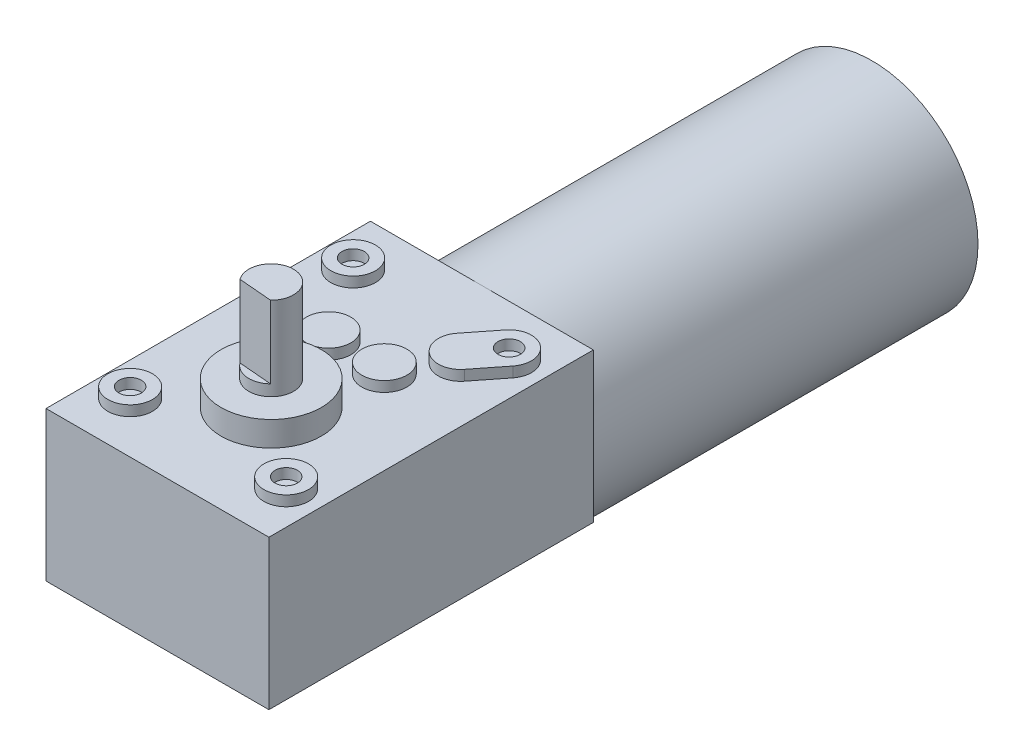
ISO-10303-21;
HEADER;
FILE_DESCRIPTION(('STEP AP214'),'2;1');
FILE_NAME('part.step','',(''),(''),'','','');
FILE_SCHEMA(('AUTOMOTIVE_DESIGN { 1 0 10303 214 1 1 1 1 }'));
ENDSEC;
DATA;
#1=APPLICATION_CONTEXT('core data for automotive mechanical design processes');
#2=APPLICATION_PROTOCOL_DEFINITION('international standard','automotive_design',2000,#1);
#3=PRODUCT_CONTEXT('',#1,'mechanical');
#4=PRODUCT('Part','Part','',(#3));
#5=PRODUCT_RELATED_PRODUCT_CATEGORY('part','',(#4));
#6=PRODUCT_DEFINITION_FORMATION('','',#4);
#7=PRODUCT_DEFINITION_CONTEXT('part definition',#1,'design');
#8=PRODUCT_DEFINITION('design','',#6,#7);
#9=PRODUCT_DEFINITION_SHAPE('','',#8);
#10=(LENGTH_UNIT() NAMED_UNIT(*) SI_UNIT(.MILLI.,.METRE.));
#11=(NAMED_UNIT(*) PLANE_ANGLE_UNIT() SI_UNIT($,.RADIAN.));
#12=(NAMED_UNIT(*) SI_UNIT($,.STERADIAN.) SOLID_ANGLE_UNIT());
#13=UNCERTAINTY_MEASURE_WITH_UNIT(LENGTH_MEASURE(1.E-05),#10,'distance_accuracy_value','');
#14=(GEOMETRIC_REPRESENTATION_CONTEXT(3) GLOBAL_UNCERTAINTY_ASSIGNED_CONTEXT((#13)) GLOBAL_UNIT_ASSIGNED_CONTEXT((#10,
#11,#12)) REPRESENTATION_CONTEXT('',''));
#15=CARTESIAN_POINT('',(0.,0.,0.));
#16=DIRECTION('',(0.,0.,1.));
#17=DIRECTION('',(1.,0.,0.));
#18=AXIS2_PLACEMENT_3D('',#15,#16,#17);
#19=CARTESIAN_POINT('',(-5.,20.9172776458894,92.5));
#20=DIRECTION('',(0.,-1.,0.));
#21=DIRECTION('',(0.,0.,-1.));
#22=AXIS2_PLACEMENT_3D('',#19,#20,#21);
#23=CYLINDRICAL_SURFACE('',#22,4.);
#24=CARTESIAN_POINT('',(-5.,20.9172776458894,92.5));
#25=DIRECTION('',(0.,1.,0.));
#26=DIRECTION('',(0.,0.,1.));
#27=AXIS2_PLACEMENT_3D('',#24,#25,#26);
#28=CIRCLE('',#27,4.);
#29=CARTESIAN_POINT('',(-5.,20.9172776458894,96.5));
#30=VERTEX_POINT('',#29);
#31=EDGE_CURVE('E11',#30,#30,#28,.T.);
#32=ORIENTED_EDGE('',*,*,#31,.F.);
#33=EDGE_LOOP('',(#32));
#34=FACE_BOUND('',#33,.T.);
#35=CARTESIAN_POINT('',(-5.,-9.58272235411055,92.5));
#36=DIRECTION('',(0.,1.,0.));
#37=DIRECTION('',(0.,0.,1.));
#38=AXIS2_PLACEMENT_3D('',#35,#36,#37);
#39=CIRCLE('',#38,4.);
#40=CARTESIAN_POINT('',(-5.,-9.58272235411055,96.5));
#41=VERTEX_POINT('',#40);
#42=EDGE_CURVE('E50',#41,#41,#39,.T.);
#43=ORIENTED_EDGE('',*,*,#42,.T.);
#44=EDGE_LOOP('',(#43));
#45=FACE_BOUND('',#44,.T.);
#46=ADVANCED_FACE('F44',(#34,#45),#23,.T.);
#47=CARTESIAN_POINT('',(-5.,20.9172776458894,92.5));
#48=DIRECTION('',(0.,1.,0.));
#49=DIRECTION('',(0.,0.,1.));
#50=AXIS2_PLACEMENT_3D('',#47,#48,#49);
#51=PLANE('',#50);
#52=ORIENTED_EDGE('',*,*,#31,.T.);
#53=EDGE_LOOP('',(#52));
#54=FACE_BOUND('',#53,.T.);
#55=ADVANCED_FACE('F59',(#54),#51,.T.);
#56=CARTESIAN_POINT('',(-5.,-9.58272235411055,92.5));
#57=DIRECTION('',(0.,1.,0.));
#58=DIRECTION('',(0.,0.,1.));
#59=AXIS2_PLACEMENT_3D('',#56,#57,#58);
#60=PLANE('',#59);
#61=ORIENTED_EDGE('',*,*,#42,.F.);
#62=EDGE_LOOP('',(#61));
#63=FACE_BOUND('',#62,.T.);
#64=ADVANCED_FACE('F57',(#63),#60,.F.);
#65=CLOSED_SHELL('',(#46,#55,#64));
#66=MANIFOLD_SOLID_BREP('B2',#65);
#67=CARTESIAN_POINT('',(5.,20.9172776458894,92.5));
#68=DIRECTION('',(0.,-1.,0.));
#69=DIRECTION('',(0.,0.,-1.));
#70=AXIS2_PLACEMENT_3D('',#67,#68,#69);
#71=CYLINDRICAL_SURFACE('',#70,4.04999462988726);
#72=CARTESIAN_POINT('',(5.,20.9172776458894,92.5));
#73=DIRECTION('',(0.,1.,0.));
#74=DIRECTION('',(0.,0.,1.));
#75=AXIS2_PLACEMENT_3D('',#72,#73,#74);
#76=CIRCLE('',#75,4.04999462988726);
#77=CARTESIAN_POINT('',(5.,20.9172776458894,96.5499946298873));
#78=VERTEX_POINT('',#77);
#79=EDGE_CURVE('E43',#78,#78,#76,.T.);
#80=ORIENTED_EDGE('',*,*,#79,.F.);
#81=EDGE_LOOP('',(#80));
#82=FACE_BOUND('',#81,.T.);
#83=CARTESIAN_POINT('',(5.,-9.58272235411055,92.5));
#84=DIRECTION('',(0.,1.,0.));
#85=DIRECTION('',(0.,0.,1.));
#86=AXIS2_PLACEMENT_3D('',#83,#84,#85);
#87=CIRCLE('',#86,4.04999462988726);
#88=CARTESIAN_POINT('',(5.,-9.58272235411055,96.5499946298873));
#89=VERTEX_POINT('',#88);
#90=EDGE_CURVE('E99',#89,#89,#87,.T.);
#91=ORIENTED_EDGE('',*,*,#90,.T.);
#92=EDGE_LOOP('',(#91));
#93=FACE_BOUND('',#92,.T.);
#94=ADVANCED_FACE('F93',(#82,#93),#71,.T.);
#95=CARTESIAN_POINT('',(5.,20.9172776458894,92.5));
#96=DIRECTION('',(0.,1.,0.));
#97=DIRECTION('',(0.,0.,1.));
#98=AXIS2_PLACEMENT_3D('',#95,#96,#97);
#99=PLANE('',#98);
#100=ORIENTED_EDGE('',*,*,#79,.T.);
#101=EDGE_LOOP('',(#100));
#102=FACE_BOUND('',#101,.T.);
#103=ADVANCED_FACE('F108',(#102),#99,.T.);
#104=CARTESIAN_POINT('',(5.,-9.58272235411055,92.5));
#105=DIRECTION('',(0.,1.,0.));
#106=DIRECTION('',(0.,0.,1.));
#107=AXIS2_PLACEMENT_3D('',#104,#105,#106);
#108=PLANE('',#107);
#109=ORIENTED_EDGE('',*,*,#90,.F.);
#110=EDGE_LOOP('',(#109));
#111=FACE_BOUND('',#110,.T.);
#112=ADVANCED_FACE('F106',(#111),#108,.F.);
#113=CLOSED_SHELL('',(#94,#103,#112));
#114=MANIFOLD_SOLID_BREP('B6',#113);
#115=CARTESIAN_POINT('',(-13.9950806120326,20.9172776458894,79.1));
#116=DIRECTION('',(0.,1.,0.));
#117=DIRECTION('',(0.,0.,1.));
#118=AXIS2_PLACEMENT_3D('',#115,#116,#117);
#119=PLANE('',#118);
#120=CARTESIAN_POINT('',(-13.9950806120326,20.9172776458894,79.1));
#121=DIRECTION('',(0.,1.,0.));
#122=DIRECTION('',(0.,0.,1.));
#123=AXIS2_PLACEMENT_3D('',#120,#121,#122);
#124=CIRCLE('',#123,4.);
#125=CARTESIAN_POINT('',(-13.9950806120326,20.9172776458894,83.1));
#126=VERTEX_POINT('',#125);
#127=EDGE_CURVE('E92',#126,#126,#124,.T.);
#128=ORIENTED_EDGE('',*,*,#127,.T.);
#129=EDGE_LOOP('',(#128));
#130=FACE_BOUND('',#129,.T.);
#131=CARTESIAN_POINT('',(-13.9950806120326,20.9172776458894,79.1));
#132=DIRECTION('',(0.,1.,0.));
#133=DIRECTION('',(0.,0.,1.));
#134=AXIS2_PLACEMENT_3D('',#131,#132,#133);
#135=CIRCLE('',#134,2.);
#136=CARTESIAN_POINT('',(-13.9950806120326,20.9172776458894,81.1));
#137=VERTEX_POINT('',#136);
#138=EDGE_CURVE('E151',#137,#137,#135,.T.);
#139=ORIENTED_EDGE('',*,*,#138,.F.);
#140=EDGE_LOOP('',(#139));
#141=FACE_BOUND('',#140,.T.);
#142=ADVANCED_FACE('F144',(#130,#141),#119,.T.);
#143=CARTESIAN_POINT('',(-13.9950806120326,20.9172776458894,79.1));
#144=DIRECTION('',(0.,-1.,0.));
#145=DIRECTION('',(0.,0.,-1.));
#146=AXIS2_PLACEMENT_3D('',#143,#144,#145);
#147=CYLINDRICAL_SURFACE('',#146,4.);
#148=ORIENTED_EDGE('',*,*,#127,.F.);
#149=EDGE_LOOP('',(#148));
#150=FACE_BOUND('',#149,.T.);
#151=CARTESIAN_POINT('',(-13.9950806120326,-9.58272235411055,79.1));
#152=DIRECTION('',(0.,1.,0.));
#153=DIRECTION('',(0.,0.,1.));
#154=AXIS2_PLACEMENT_3D('',#151,#152,#153);
#155=CIRCLE('',#154,4.);
#156=CARTESIAN_POINT('',(-13.9950806120326,-9.58272235411055,83.1));
#157=VERTEX_POINT('',#156);
#158=EDGE_CURVE('E155',#157,#157,#155,.T.);
#159=ORIENTED_EDGE('',*,*,#158,.T.);
#160=EDGE_LOOP('',(#159));
#161=FACE_BOUND('',#160,.T.);
#162=ADVANCED_FACE('F146',(#150,#161),#147,.T.);
#163=CARTESIAN_POINT('',(-13.9950806120326,20.9172776458894,79.1));
#164=DIRECTION('',(0.,-1.,0.));
#165=DIRECTION('',(0.,0.,-1.));
#166=AXIS2_PLACEMENT_3D('',#163,#164,#165);
#167=CYLINDRICAL_SURFACE('',#166,2.);
#168=ORIENTED_EDGE('',*,*,#138,.T.);
#169=EDGE_LOOP('',(#168));
#170=FACE_BOUND('',#169,.T.);
#171=CARTESIAN_POINT('',(-13.9950806120326,-9.58272235411055,79.1));
#172=DIRECTION('',(0.,1.,0.));
#173=DIRECTION('',(0.,0.,1.));
#174=AXIS2_PLACEMENT_3D('',#171,#172,#173);
#175=CIRCLE('',#174,2.);
#176=CARTESIAN_POINT('',(-13.9950806120326,-9.58272235411055,81.1));
#177=VERTEX_POINT('',#176);
#178=EDGE_CURVE('E159',#177,#177,#175,.T.);
#179=ORIENTED_EDGE('',*,*,#178,.F.);
#180=EDGE_LOOP('',(#179));
#181=FACE_BOUND('',#180,.T.);
#182=ADVANCED_FACE('F168',(#170,#181),#167,.F.);
#183=CARTESIAN_POINT('',(-13.9950806120326,-9.58272235411055,79.1));
#184=DIRECTION('',(0.,1.,0.));
#185=DIRECTION('',(0.,0.,1.));
#186=AXIS2_PLACEMENT_3D('',#183,#184,#185);
#187=PLANE('',#186);
#188=ORIENTED_EDGE('',*,*,#178,.T.);
#189=EDGE_LOOP('',(#188));
#190=FACE_BOUND('',#189,.T.);
#191=ORIENTED_EDGE('',*,*,#158,.F.);
#192=EDGE_LOOP('',(#191));
#193=FACE_BOUND('',#192,.T.);
#194=ADVANCED_FACE('F165',(#190,#193),#187,.F.);
#195=CLOSED_SHELL('',(#142,#162,#182,#194));
#196=MANIFOLD_SOLID_BREP('B38',#195);
#197=CARTESIAN_POINT('',(13.9950806120326,20.9172776458894,79.1));
#198=DIRECTION('',(0.,1.,0.));
#199=DIRECTION('',(0.,0.,1.));
#200=AXIS2_PLACEMENT_3D('',#197,#198,#199);
#201=PLANE('',#200);
#202=CARTESIAN_POINT('',(13.9950806120326,20.9172776458894,79.1));
#203=DIRECTION('',(0.,1.,0.));
#204=DIRECTION('',(0.,0.,1.));
#205=AXIS2_PLACEMENT_3D('',#202,#203,#204);
#206=CIRCLE('',#205,3.99215928840922);
#207=CARTESIAN_POINT('',(17.1308988757399,20.9172776458894,81.5706233223686));
#208=VERTEX_POINT('',#207);
#209=CARTESIAN_POINT('',(10.8592623483253,20.9172776458894,76.6293766776314));
#210=VERTEX_POINT('',#209);
#211=EDGE_CURVE('E284',#208,#210,#206,.T.);
#212=ORIENTED_EDGE('',*,*,#211,.T.);
#213=DIRECTION('',(-0.618868923778116,0.,0.785494274442351));
#214=VECTOR('',#213,1.);
#215=CARTESIAN_POINT('',(10.8592623483253,20.9172776458894,76.6293766776314));
#216=LINE('',#215,#214);
#217=CARTESIAN_POINT('',(7.01921466581358,20.9172776458894,81.5033255096138));
#218=VERTEX_POINT('',#217);
#219=EDGE_CURVE('E258',#210,#218,#216,.T.);
#220=ORIENTED_EDGE('',*,*,#219,.T.);
#221=CARTESIAN_POINT('',(10.1550329295209,20.9172776458894,83.9739488319825));
#222=DIRECTION('',(0.,1.,0.));
#223=DIRECTION('',(0.,0.,1.));
#224=AXIS2_PLACEMENT_3D('',#221,#222,#223);
#225=CIRCLE('',#224,3.99215928840922);
#226=CARTESIAN_POINT('',(13.2908511932282,20.9172776458894,86.4445721543511));
#227=VERTEX_POINT('',#226);
#228=EDGE_CURVE('E234',#218,#227,#225,.T.);
#229=ORIENTED_EDGE('',*,*,#228,.T.);
#230=DIRECTION('',(0.618868923778116,0.,-0.785494274442351));
#231=VECTOR('',#230,1.);
#232=CARTESIAN_POINT('',(17.1308988757399,20.9172776458894,81.5706233223686));
#233=LINE('',#232,#231);
#234=EDGE_CURVE('E229',#227,#208,#233,.T.);
#235=ORIENTED_EDGE('',*,*,#234,.T.);
#236=EDGE_LOOP('',(#212,#220,#229,#235));
#237=FACE_BOUND('',#236,.T.);
#238=CARTESIAN_POINT('',(13.9950806120326,20.9172776458894,79.1));
#239=DIRECTION('',(0.,1.,0.));
#240=DIRECTION('',(0.,0.,1.));
#241=AXIS2_PLACEMENT_3D('',#238,#239,#240);
#242=CIRCLE('',#241,2.00000000000001);
#243=CARTESIAN_POINT('',(13.9950806120326,20.9172776458894,81.1));
#244=VERTEX_POINT('',#243);
#245=EDGE_CURVE('E281',#244,#244,#242,.T.);
#246=ORIENTED_EDGE('',*,*,#245,.F.);
#247=EDGE_LOOP('',(#246));
#248=FACE_BOUND('',#247,.T.);
#249=ADVANCED_FACE('F214',(#237,#248),#201,.T.);
#250=CARTESIAN_POINT('',(13.9950806120326,20.9172776458894,79.1));
#251=DIRECTION('',(0.,-1.,0.));
#252=DIRECTION('',(0.,0.,-1.));
#253=AXIS2_PLACEMENT_3D('',#250,#251,#252);
#254=CYLINDRICAL_SURFACE('',#253,3.99215928840922);
#255=DIRECTION('',(0.,-1.,0.));
#256=VECTOR('',#255,1.);
#257=CARTESIAN_POINT('',(17.1308988757399,20.9172776458894,81.5706233223686));
#258=LINE('',#257,#256);
#259=CARTESIAN_POINT('',(17.1308988757399,-9.58272235411055,81.5706233223686));
#260=VERTEX_POINT('',#259);
#261=EDGE_CURVE('E272',#208,#260,#258,.T.);
#262=ORIENTED_EDGE('',*,*,#261,.T.);
#263=CARTESIAN_POINT('',(13.9950806120326,-9.58272235411055,79.1));
#264=DIRECTION('',(0.,1.,0.));
#265=DIRECTION('',(0.,0.,1.));
#266=AXIS2_PLACEMENT_3D('',#263,#264,#265);
#267=CIRCLE('',#266,3.99215928840922);
#268=CARTESIAN_POINT('',(10.8592623483253,-9.58272235411055,76.6293766776314));
#269=VERTEX_POINT('',#268);
#270=EDGE_CURVE('E267',#260,#269,#267,.T.);
#271=ORIENTED_EDGE('',*,*,#270,.T.);
#272=DIRECTION('',(0.,-1.,0.));
#273=VECTOR('',#272,1.);
#274=CARTESIAN_POINT('',(10.8592623483253,20.9172776458894,76.6293766776314));
#275=LINE('',#274,#273);
#276=EDGE_CURVE('E142',#210,#269,#275,.T.);
#277=ORIENTED_EDGE('',*,*,#276,.F.);
#278=ORIENTED_EDGE('',*,*,#211,.F.);
#279=EDGE_LOOP('',(#262,#271,#277,#278));
#280=FACE_BOUND('',#279,.T.);
#281=ADVANCED_FACE('F216',(#280),#254,.T.);
#282=CARTESIAN_POINT('',(10.8592623483253,20.9172776458894,76.6293766776314));
#283=DIRECTION('',(0.785494274442352,0.,0.618868923778116));
#284=DIRECTION('',(0.618868923778116,0.,-0.785494274442352));
#285=AXIS2_PLACEMENT_3D('',#282,#283,#284);
#286=PLANE('',#285);
#287=ORIENTED_EDGE('',*,*,#276,.T.);
#288=DIRECTION('',(-0.618868923778116,0.,0.785494274442351));
#289=VECTOR('',#288,1.);
#290=CARTESIAN_POINT('',(10.8592623483253,-9.58272235411055,76.6293766776314));
#291=LINE('',#290,#289);
#292=CARTESIAN_POINT('',(7.01921466581358,-9.58272235411055,81.5033255096138));
#293=VERTEX_POINT('',#292);
#294=EDGE_CURVE('E257',#269,#293,#291,.T.);
#295=ORIENTED_EDGE('',*,*,#294,.T.);
#296=DIRECTION('',(0.,-1.,0.));
#297=VECTOR('',#296,1.);
#298=CARTESIAN_POINT('',(7.01921466581358,20.9172776458894,81.5033255096138));
#299=LINE('',#298,#297);
#300=EDGE_CURVE('E222',#218,#293,#299,.T.);
#301=ORIENTED_EDGE('',*,*,#300,.F.);
#302=ORIENTED_EDGE('',*,*,#219,.F.);
#303=EDGE_LOOP('',(#287,#295,#301,#302));
#304=FACE_BOUND('',#303,.T.);
#305=ADVANCED_FACE('F255',(#304),#286,.F.);
#306=CARTESIAN_POINT('',(10.1550329295209,20.9172776458894,83.9739488319825));
#307=DIRECTION('',(0.,-1.,0.));
#308=DIRECTION('',(0.,0.,-1.));
#309=AXIS2_PLACEMENT_3D('',#306,#307,#308);
#310=CYLINDRICAL_SURFACE('',#309,3.99215928840922);
#311=ORIENTED_EDGE('',*,*,#300,.T.);
#312=CARTESIAN_POINT('',(10.1550329295209,-9.58272235411055,83.9739488319825));
#313=DIRECTION('',(0.,1.,0.));
#314=DIRECTION('',(0.,0.,1.));
#315=AXIS2_PLACEMENT_3D('',#312,#313,#314);
#316=CIRCLE('',#315,3.99215928840922);
#317=CARTESIAN_POINT('',(13.2908511932282,-9.58272235411055,86.4445721543511));
#318=VERTEX_POINT('',#317);
#319=EDGE_CURVE('E270',#293,#318,#316,.T.);
#320=ORIENTED_EDGE('',*,*,#319,.T.);
#321=DIRECTION('',(0.,-1.,0.));
#322=VECTOR('',#321,1.);
#323=CARTESIAN_POINT('',(13.2908511932282,20.9172776458894,86.4445721543511));
#324=LINE('',#323,#322);
#325=EDGE_CURVE('E290',#227,#318,#324,.T.);
#326=ORIENTED_EDGE('',*,*,#325,.F.);
#327=ORIENTED_EDGE('',*,*,#228,.F.);
#328=EDGE_LOOP('',(#311,#320,#326,#327));
#329=FACE_BOUND('',#328,.T.);
#330=ADVANCED_FACE('F292',(#329),#310,.T.);
#331=CARTESIAN_POINT('',(17.1308988757399,20.9172776458894,81.5706233223686));
#332=DIRECTION('',(-0.785494274442352,0.,-0.618868923778116));
#333=DIRECTION('',(-0.618868923778116,0.,0.785494274442352));
#334=AXIS2_PLACEMENT_3D('',#331,#332,#333);
#335=PLANE('',#334);
#336=ORIENTED_EDGE('',*,*,#325,.T.);
#337=DIRECTION('',(0.618868923778116,0.,-0.785494274442351));
#338=VECTOR('',#337,1.);
#339=CARTESIAN_POINT('',(17.1308988757399,-9.58272235411055,81.5706233223686));
#340=LINE('',#339,#338);
#341=EDGE_CURVE('E279',#318,#260,#340,.T.);
#342=ORIENTED_EDGE('',*,*,#341,.T.);
#343=ORIENTED_EDGE('',*,*,#261,.F.);
#344=ORIENTED_EDGE('',*,*,#234,.F.);
#345=EDGE_LOOP('',(#336,#342,#343,#344));
#346=FACE_BOUND('',#345,.T.);
#347=ADVANCED_FACE('F294',(#346),#335,.F.);
#348=CARTESIAN_POINT('',(13.9950806120326,20.9172776458894,79.1));
#349=DIRECTION('',(0.,-1.,0.));
#350=DIRECTION('',(0.,0.,-1.));
#351=AXIS2_PLACEMENT_3D('',#348,#349,#350);
#352=CYLINDRICAL_SURFACE('',#351,2.00000000000001);
#353=ORIENTED_EDGE('',*,*,#245,.T.);
#354=EDGE_LOOP('',(#353));
#355=FACE_BOUND('',#354,.T.);
#356=CARTESIAN_POINT('',(13.9950806120326,-9.58272235411055,79.1));
#357=DIRECTION('',(0.,1.,0.));
#358=DIRECTION('',(0.,0.,1.));
#359=AXIS2_PLACEMENT_3D('',#356,#357,#358);
#360=CIRCLE('',#359,2.00000000000001);
#361=CARTESIAN_POINT('',(13.9950806120326,-9.58272235411055,81.1));
#362=VERTEX_POINT('',#361);
#363=EDGE_CURVE('E273',#362,#362,#360,.T.);
#364=ORIENTED_EDGE('',*,*,#363,.F.);
#365=EDGE_LOOP('',(#364));
#366=FACE_BOUND('',#365,.T.);
#367=ADVANCED_FACE('F300',(#355,#366),#352,.F.);
#368=CARTESIAN_POINT('',(13.9950806120326,-9.58272235411055,79.1));
#369=DIRECTION('',(0.,1.,0.));
#370=DIRECTION('',(0.,0.,1.));
#371=AXIS2_PLACEMENT_3D('',#368,#369,#370);
#372=PLANE('',#371);
#373=ORIENTED_EDGE('',*,*,#363,.T.);
#374=EDGE_LOOP('',(#373));
#375=FACE_BOUND('',#374,.T.);
#376=ORIENTED_EDGE('',*,*,#270,.F.);
#377=ORIENTED_EDGE('',*,*,#341,.F.);
#378=ORIENTED_EDGE('',*,*,#319,.F.);
#379=ORIENTED_EDGE('',*,*,#294,.F.);
#380=EDGE_LOOP('',(#376,#377,#378,#379));
#381=FACE_BOUND('',#380,.T.);
#382=ADVANCED_FACE('F265',(#375,#381),#372,.F.);
#383=CLOSED_SHELL('',(#249,#281,#305,#330,#347,#367,#382));
#384=MANIFOLD_SOLID_BREP('B87',#383);
#385=CARTESIAN_POINT('',(-13.9950806120326,20.9172776458894,119.1));
#386=DIRECTION('',(0.,1.,0.));
#387=DIRECTION('',(0.,0.,1.));
#388=AXIS2_PLACEMENT_3D('',#385,#386,#387);
#389=PLANE('',#388);
#390=CARTESIAN_POINT('',(-13.9950806120326,20.9172776458894,119.1));
#391=DIRECTION('',(0.,1.,0.));
#392=DIRECTION('',(0.,0.,1.));
#393=AXIS2_PLACEMENT_3D('',#390,#391,#392);
#394=CIRCLE('',#393,4.);
#395=CARTESIAN_POINT('',(-13.9950806120326,20.9172776458894,123.1));
#396=VERTEX_POINT('',#395);
#397=EDGE_CURVE('E213',#396,#396,#394,.T.);
#398=ORIENTED_EDGE('',*,*,#397,.T.);
#399=EDGE_LOOP('',(#398));
#400=FACE_BOUND('',#399,.T.);
#401=CARTESIAN_POINT('',(-13.9950806120326,20.9172776458894,119.1));
#402=DIRECTION('',(0.,1.,0.));
#403=DIRECTION('',(0.,0.,1.));
#404=AXIS2_PLACEMENT_3D('',#401,#402,#403);
#405=CIRCLE('',#404,2.);
#406=CARTESIAN_POINT('',(-13.9950806120326,20.9172776458894,121.1));
#407=VERTEX_POINT('',#406);
#408=EDGE_CURVE('E374',#407,#407,#405,.T.);
#409=ORIENTED_EDGE('',*,*,#408,.F.);
#410=EDGE_LOOP('',(#409));
#411=FACE_BOUND('',#410,.T.);
#412=ADVANCED_FACE('F367',(#400,#411),#389,.T.);
#413=CARTESIAN_POINT('',(-13.9950806120326,20.9172776458894,119.1));
#414=DIRECTION('',(0.,-1.,0.));
#415=DIRECTION('',(0.,0.,-1.));
#416=AXIS2_PLACEMENT_3D('',#413,#414,#415);
#417=CYLINDRICAL_SURFACE('',#416,4.);
#418=ORIENTED_EDGE('',*,*,#397,.F.);
#419=EDGE_LOOP('',(#418));
#420=FACE_BOUND('',#419,.T.);
#421=CARTESIAN_POINT('',(-13.9950806120326,-9.58272235411055,119.1));
#422=DIRECTION('',(0.,1.,0.));
#423=DIRECTION('',(0.,0.,1.));
#424=AXIS2_PLACEMENT_3D('',#421,#422,#423);
#425=CIRCLE('',#424,4.);
#426=CARTESIAN_POINT('',(-13.9950806120326,-9.58272235411055,123.1));
#427=VERTEX_POINT('',#426);
#428=EDGE_CURVE('E378',#427,#427,#425,.T.);
#429=ORIENTED_EDGE('',*,*,#428,.T.);
#430=EDGE_LOOP('',(#429));
#431=FACE_BOUND('',#430,.T.);
#432=ADVANCED_FACE('F369',(#420,#431),#417,.T.);
#433=CARTESIAN_POINT('',(-13.9950806120326,20.9172776458894,119.1));
#434=DIRECTION('',(0.,-1.,0.));
#435=DIRECTION('',(0.,0.,-1.));
#436=AXIS2_PLACEMENT_3D('',#433,#434,#435);
#437=CYLINDRICAL_SURFACE('',#436,2.);
#438=ORIENTED_EDGE('',*,*,#408,.T.);
#439=EDGE_LOOP('',(#438));
#440=FACE_BOUND('',#439,.T.);
#441=CARTESIAN_POINT('',(-13.9950806120326,-9.58272235411055,119.1));
#442=DIRECTION('',(0.,1.,0.));
#443=DIRECTION('',(0.,0.,1.));
#444=AXIS2_PLACEMENT_3D('',#441,#442,#443);
#445=CIRCLE('',#444,2.);
#446=CARTESIAN_POINT('',(-13.9950806120326,-9.58272235411055,121.1));
#447=VERTEX_POINT('',#446);
#448=EDGE_CURVE('E382',#447,#447,#445,.T.);
#449=ORIENTED_EDGE('',*,*,#448,.F.);
#450=EDGE_LOOP('',(#449));
#451=FACE_BOUND('',#450,.T.);
#452=ADVANCED_FACE('F391',(#440,#451),#437,.F.);
#453=CARTESIAN_POINT('',(-13.9950806120326,-9.58272235411055,119.1));
#454=DIRECTION('',(0.,1.,0.));
#455=DIRECTION('',(0.,0.,1.));
#456=AXIS2_PLACEMENT_3D('',#453,#454,#455);
#457=PLANE('',#456);
#458=ORIENTED_EDGE('',*,*,#448,.T.);
#459=EDGE_LOOP('',(#458));
#460=FACE_BOUND('',#459,.T.);
#461=ORIENTED_EDGE('',*,*,#428,.F.);
#462=EDGE_LOOP('',(#461));
#463=FACE_BOUND('',#462,.T.);
#464=ADVANCED_FACE('F388',(#460,#463),#457,.F.);
#465=CLOSED_SHELL('',(#412,#432,#452,#464));
#466=MANIFOLD_SOLID_BREP('B136',#465);
#467=CARTESIAN_POINT('',(13.9950806120326,20.9172776458894,119.1));
#468=DIRECTION('',(0.,1.,0.));
#469=DIRECTION('',(0.,0.,1.));
#470=AXIS2_PLACEMENT_3D('',#467,#468,#469);
#471=PLANE('',#470);
#472=CARTESIAN_POINT('',(13.9950806120326,20.9172776458894,119.1));
#473=DIRECTION('',(0.,1.,0.));
#474=DIRECTION('',(0.,0.,1.));
#475=AXIS2_PLACEMENT_3D('',#472,#473,#474);
#476=CIRCLE('',#475,4.);
#477=CARTESIAN_POINT('',(13.9950806120326,20.9172776458894,123.1));
#478=VERTEX_POINT('',#477);
#479=EDGE_CURVE('E366',#478,#478,#476,.T.);
#480=ORIENTED_EDGE('',*,*,#479,.T.);
#481=EDGE_LOOP('',(#480));
#482=FACE_BOUND('',#481,.T.);
#483=CARTESIAN_POINT('',(13.9950806120326,20.9172776458894,119.1));
#484=DIRECTION('',(0.,1.,0.));
#485=DIRECTION('',(0.,0.,1.));
#486=AXIS2_PLACEMENT_3D('',#483,#484,#485);
#487=CIRCLE('',#486,2.);
#488=CARTESIAN_POINT('',(13.9950806120326,20.9172776458894,121.1));
#489=VERTEX_POINT('',#488);
#490=EDGE_CURVE('E445',#489,#489,#487,.T.);
#491=ORIENTED_EDGE('',*,*,#490,.F.);
#492=EDGE_LOOP('',(#491));
#493=FACE_BOUND('',#492,.T.);
#494=ADVANCED_FACE('F438',(#482,#493),#471,.T.);
#495=CARTESIAN_POINT('',(13.9950806120326,20.9172776458894,119.1));
#496=DIRECTION('',(0.,-1.,0.));
#497=DIRECTION('',(0.,0.,-1.));
#498=AXIS2_PLACEMENT_3D('',#495,#496,#497);
#499=CYLINDRICAL_SURFACE('',#498,4.);
#500=ORIENTED_EDGE('',*,*,#479,.F.);
#501=EDGE_LOOP('',(#500));
#502=FACE_BOUND('',#501,.T.);
#503=CARTESIAN_POINT('',(13.9950806120326,-9.58272235411055,119.1));
#504=DIRECTION('',(0.,1.,0.));
#505=DIRECTION('',(0.,0.,1.));
#506=AXIS2_PLACEMENT_3D('',#503,#504,#505);
#507=CIRCLE('',#506,4.);
#508=CARTESIAN_POINT('',(13.9950806120326,-9.58272235411055,123.1));
#509=VERTEX_POINT('',#508);
#510=EDGE_CURVE('E449',#509,#509,#507,.T.);
#511=ORIENTED_EDGE('',*,*,#510,.T.);
#512=EDGE_LOOP('',(#511));
#513=FACE_BOUND('',#512,.T.);
#514=ADVANCED_FACE('F440',(#502,#513),#499,.T.);
#515=CARTESIAN_POINT('',(13.9950806120326,20.9172776458894,119.1));
#516=DIRECTION('',(0.,-1.,0.));
#517=DIRECTION('',(0.,0.,-1.));
#518=AXIS2_PLACEMENT_3D('',#515,#516,#517);
#519=CYLINDRICAL_SURFACE('',#518,2.);
#520=ORIENTED_EDGE('',*,*,#490,.T.);
#521=EDGE_LOOP('',(#520));
#522=FACE_BOUND('',#521,.T.);
#523=CARTESIAN_POINT('',(13.9950806120326,-9.58272235411055,119.1));
#524=DIRECTION('',(0.,1.,0.));
#525=DIRECTION('',(0.,0.,1.));
#526=AXIS2_PLACEMENT_3D('',#523,#524,#525);
#527=CIRCLE('',#526,2.);
#528=CARTESIAN_POINT('',(13.9950806120326,-9.58272235411055,121.1));
#529=VERTEX_POINT('',#528);
#530=EDGE_CURVE('E453',#529,#529,#527,.T.);
#531=ORIENTED_EDGE('',*,*,#530,.F.);
#532=EDGE_LOOP('',(#531));
#533=FACE_BOUND('',#532,.T.);
#534=ADVANCED_FACE('F462',(#522,#533),#519,.F.);
#535=CARTESIAN_POINT('',(13.9950806120326,-9.58272235411055,119.1));
#536=DIRECTION('',(0.,1.,0.));
#537=DIRECTION('',(0.,0.,1.));
#538=AXIS2_PLACEMENT_3D('',#535,#536,#537);
#539=PLANE('',#538);
#540=ORIENTED_EDGE('',*,*,#530,.T.);
#541=EDGE_LOOP('',(#540));
#542=FACE_BOUND('',#541,.T.);
#543=ORIENTED_EDGE('',*,*,#510,.F.);
#544=EDGE_LOOP('',(#543));
#545=FACE_BOUND('',#544,.T.);
#546=ADVANCED_FACE('F459',(#542,#545),#539,.F.);
#547=CLOSED_SHELL('',(#494,#514,#534,#546));
#548=MANIFOLD_SOLID_BREP('B208',#547);
#549=CARTESIAN_POINT('',(0.,0.,70.));
#550=DIRECTION('',(0.,0.,-1.));
#551=DIRECTION('',(-1.,0.,0.));
#552=AXIS2_PLACEMENT_3D('',#549,#550,#551);
#553=CYLINDRICAL_SURFACE('',#552,19.);
#554=CARTESIAN_POINT('',(0.,0.,70.));
#555=DIRECTION('',(0.,0.,1.));
#556=DIRECTION('',(1.,0.,0.));
#557=AXIS2_PLACEMENT_3D('',#554,#555,#556);
#558=CIRCLE('',#557,19.);
#559=CARTESIAN_POINT('',(-17.3532283633455,-7.73727764588945,70.));
#560=VERTEX_POINT('',#559);
#561=CARTESIAN_POINT('',(17.3532283633455,-7.73727764588945,70.));
#562=VERTEX_POINT('',#561);
#563=EDGE_CURVE('E623',#560,#562,#558,.T.);
#564=ORIENTED_EDGE('',*,*,#563,.F.);
#565=EDGE_CURVE('E624',#562,#560,#558,.T.);
#566=ORIENTED_EDGE('',*,*,#565,.F.);
#567=EDGE_LOOP('',(#564,#566));
#568=FACE_BOUND('',#567,.T.);
#569=CARTESIAN_POINT('',(0.,0.,0.));
#570=DIRECTION('',(0.,0.,1.));
#571=DIRECTION('',(1.,0.,0.));
#572=AXIS2_PLACEMENT_3D('',#569,#570,#571);
#573=CIRCLE('',#572,19.);
#574=CARTESIAN_POINT('',(19.,0.,0.));
#575=VERTEX_POINT('',#574);
#576=EDGE_CURVE('E622',#575,#575,#573,.T.);
#577=ORIENTED_EDGE('',*,*,#576,.T.);
#578=EDGE_LOOP('',(#577));
#579=FACE_BOUND('',#578,.T.);
#580=ADVANCED_FACE('F500',(#568,#579),#553,.T.);
#581=CARTESIAN_POINT('',(0.,0.,70.));
#582=DIRECTION('',(0.,0.,1.));
#583=DIRECTION('',(1.,0.,0.));
#584=AXIS2_PLACEMENT_3D('',#581,#582,#583);
#585=PLANE('',#584);
#586=DIRECTION('',(1.,0.,0.));
#587=VECTOR('',#586,1.);
#588=CARTESIAN_POINT('',(-19.9950806120326,-7.73727764588945,70.));
#589=LINE('',#588,#587);
#590=EDGE_CURVE('E508',#560,#562,#589,.T.);
#591=ORIENTED_EDGE('',*,*,#590,.F.);
#592=ORIENTED_EDGE('',*,*,#563,.T.);
#593=EDGE_LOOP('',(#591,#592));
#594=FACE_BOUND('',#593,.T.);
#595=ADVANCED_FACE('F669',(#594),#585,.T.);
#596=CARTESIAN_POINT('',(0.,0.,0.));
#597=DIRECTION('',(0.,0.,1.));
#598=DIRECTION('',(1.,0.,0.));
#599=AXIS2_PLACEMENT_3D('',#596,#597,#598);
#600=PLANE('',#599);
#601=ORIENTED_EDGE('',*,*,#576,.F.);
#602=EDGE_LOOP('',(#601));
#603=FACE_BOUND('',#602,.T.);
#604=ADVANCED_FACE('F673',(#603),#600,.F.);
#605=CARTESIAN_POINT('',(0.,0.,70.));
#606=DIRECTION('',(0.,0.,1.));
#607=DIRECTION('',(1.,0.,0.));
#608=AXIS2_PLACEMENT_3D('',#605,#606,#607);
#609=PLANE('',#608);
#610=CARTESIAN_POINT('',(19.9950806120326,-7.73727764588945,70.));
#611=VERTEX_POINT('',#610);
#612=EDGE_CURVE('E608',#562,#611,#589,.T.);
#613=ORIENTED_EDGE('',*,*,#612,.F.);
#614=ORIENTED_EDGE('',*,*,#565,.T.);
#615=CARTESIAN_POINT('',(-19.9950806120326,-7.73727764588945,70.));
#616=VERTEX_POINT('',#615);
#617=EDGE_CURVE('E595',#616,#560,#589,.T.);
#618=ORIENTED_EDGE('',*,*,#617,.F.);
#619=DIRECTION('',(0.,-1.,0.));
#620=VECTOR('',#619,1.);
#621=CARTESIAN_POINT('',(-19.9950806120326,19.0672776458894,70.));
#622=LINE('',#621,#620);
#623=CARTESIAN_POINT('',(-19.9950806120326,19.0672776458894,70.));
#624=VERTEX_POINT('',#623);
#625=EDGE_CURVE('E606',#624,#616,#622,.T.);
#626=ORIENTED_EDGE('',*,*,#625,.F.);
#627=DIRECTION('',(-1.,0.,0.));
#628=VECTOR('',#627,1.);
#629=CARTESIAN_POINT('',(-19.9950806120326,19.0672776458894,70.));
#630=LINE('',#629,#628);
#631=CARTESIAN_POINT('',(19.9950806120326,19.0672776458894,70.));
#632=VERTEX_POINT('',#631);
#633=EDGE_CURVE('E604',#632,#624,#630,.T.);
#634=ORIENTED_EDGE('',*,*,#633,.F.);
#635=DIRECTION('',(0.,1.,0.));
#636=VECTOR('',#635,1.);
#637=CARTESIAN_POINT('',(19.9950806120326,19.0672776458894,70.));
#638=LINE('',#637,#636);
#639=EDGE_CURVE('E590',#611,#632,#638,.T.);
#640=ORIENTED_EDGE('',*,*,#639,.F.);
#641=EDGE_LOOP('',(#613,#614,#618,#626,#634,#640));
#642=FACE_BOUND('',#641,.T.);
#643=ADVANCED_FACE('F633',(#642),#609,.F.);
#644=CARTESIAN_POINT('',(19.9950806120326,19.0672776458894,128.2));
#645=DIRECTION('',(-1.,0.,0.));
#646=DIRECTION('',(0.,0.,1.));
#647=AXIS2_PLACEMENT_3D('',#644,#645,#646);
#648=PLANE('',#647);
#649=ORIENTED_EDGE('',*,*,#639,.T.);
#650=DIRECTION('',(0.,0.,-1.));
#651=VECTOR('',#650,1.);
#652=CARTESIAN_POINT('',(19.9950806120326,19.0672776458894,128.2));
#653=LINE('',#652,#651);
#654=CARTESIAN_POINT('',(19.9950806120326,19.0672776458894,128.2));
#655=VERTEX_POINT('',#654);
#656=EDGE_CURVE('E619',#655,#632,#653,.T.);
#657=ORIENTED_EDGE('',*,*,#656,.F.);
#658=DIRECTION('',(0.,1.,0.));
#659=VECTOR('',#658,1.);
#660=CARTESIAN_POINT('',(19.9950806120326,19.0672776458894,128.2));
#661=LINE('',#660,#659);
#662=CARTESIAN_POINT('',(19.9950806120326,-7.73727764588945,128.2));
#663=VERTEX_POINT('',#662);
#664=EDGE_CURVE('E591',#663,#655,#661,.T.);
#665=ORIENTED_EDGE('',*,*,#664,.F.);
#666=DIRECTION('',(0.,0.,-1.));
#667=VECTOR('',#666,1.);
#668=CARTESIAN_POINT('',(19.9950806120326,-7.73727764588945,128.2));
#669=LINE('',#668,#667);
#670=EDGE_CURVE('E601',#663,#611,#669,.T.);
#671=ORIENTED_EDGE('',*,*,#670,.T.);
#672=EDGE_LOOP('',(#649,#657,#665,#671));
#673=FACE_BOUND('',#672,.T.);
#674=ADVANCED_FACE('F651',(#673),#648,.F.);
#675=CARTESIAN_POINT('',(-19.9950806120326,19.0672776458894,128.2));
#676=DIRECTION('',(0.,-1.,0.));
#677=DIRECTION('',(0.,0.,-1.));
#678=AXIS2_PLACEMENT_3D('',#675,#676,#677);
#679=PLANE('',#678);
#680=CARTESIAN_POINT('',(0.,19.0672776458894,107.8));
#681=DIRECTION('',(0.,-1.,0.));
#682=DIRECTION('',(0.,0.,-1.));
#683=AXIS2_PLACEMENT_3D('',#680,#681,#682);
#684=CIRCLE('',#683,8.99999999999999);
#685=CARTESIAN_POINT('',(0.,19.0672776458894,98.8));
#686=VERTEX_POINT('',#685);
#687=EDGE_CURVE('E587',#686,#686,#684,.T.);
#688=ORIENTED_EDGE('',*,*,#687,.T.);
#689=EDGE_LOOP('',(#688));
#690=FACE_BOUND('',#689,.T.);
#691=ORIENTED_EDGE('',*,*,#633,.T.);
#692=DIRECTION('',(0.,0.,-1.));
#693=VECTOR('',#692,1.);
#694=CARTESIAN_POINT('',(-19.9950806120326,19.0672776458894,128.2));
#695=LINE('',#694,#693);
#696=CARTESIAN_POINT('',(-19.9950806120326,19.0672776458894,128.2));
#697=VERTEX_POINT('',#696);
#698=EDGE_CURVE('E616',#697,#624,#695,.T.);
#699=ORIENTED_EDGE('',*,*,#698,.F.);
#700=DIRECTION('',(-1.,0.,0.));
#701=VECTOR('',#700,1.);
#702=CARTESIAN_POINT('',(-19.9950806120326,19.0672776458894,128.2));
#703=LINE('',#702,#701);
#704=EDGE_CURVE('E594',#655,#697,#703,.T.);
#705=ORIENTED_EDGE('',*,*,#704,.F.);
#706=ORIENTED_EDGE('',*,*,#656,.T.);
#707=EDGE_LOOP('',(#691,#699,#705,#706));
#708=FACE_BOUND('',#707,.T.);
#709=ADVANCED_FACE('F648',(#690,#708),#679,.F.);
#710=CARTESIAN_POINT('',(-19.9950806120326,19.0672776458894,128.2));
#711=DIRECTION('',(1.,0.,0.));
#712=DIRECTION('',(0.,0.,-1.));
#713=AXIS2_PLACEMENT_3D('',#710,#711,#712);
#714=PLANE('',#713);
#715=ORIENTED_EDGE('',*,*,#625,.T.);
#716=DIRECTION('',(0.,0.,-1.));
#717=VECTOR('',#716,1.);
#718=CARTESIAN_POINT('',(-19.9950806120326,-7.73727764588945,128.2));
#719=LINE('',#718,#717);
#720=CARTESIAN_POINT('',(-19.9950806120326,-7.73727764588945,128.2));
#721=VERTEX_POINT('',#720);
#722=EDGE_CURVE('E613',#721,#616,#719,.T.);
#723=ORIENTED_EDGE('',*,*,#722,.F.);
#724=DIRECTION('',(0.,-1.,0.));
#725=VECTOR('',#724,1.);
#726=CARTESIAN_POINT('',(-19.9950806120326,19.0672776458894,128.2));
#727=LINE('',#726,#725);
#728=EDGE_CURVE('E597',#697,#721,#727,.T.);
#729=ORIENTED_EDGE('',*,*,#728,.F.);
#730=ORIENTED_EDGE('',*,*,#698,.T.);
#731=EDGE_LOOP('',(#715,#723,#729,#730));
#732=FACE_BOUND('',#731,.T.);
#733=ADVANCED_FACE('F644',(#732),#714,.F.);
#734=CARTESIAN_POINT('',(-19.9950806120326,-7.73727764588945,128.2));
#735=DIRECTION('',(0.,1.,0.));
#736=DIRECTION('',(0.,0.,1.));
#737=AXIS2_PLACEMENT_3D('',#734,#735,#736);
#738=PLANE('',#737);
#739=CARTESIAN_POINT('',(0.,-7.73727764588945,107.8));
#740=DIRECTION('',(0.,1.,0.));
#741=DIRECTION('',(0.,0.,1.));
#742=AXIS2_PLACEMENT_3D('',#739,#740,#741);
#743=CIRCLE('',#742,8.99999999999999);
#744=CARTESIAN_POINT('',(0.,-7.73727764588945,116.8));
#745=VERTEX_POINT('',#744);
#746=EDGE_CURVE('E503',#745,#745,#743,.T.);
#747=ORIENTED_EDGE('',*,*,#746,.T.);
#748=EDGE_LOOP('',(#747));
#749=FACE_BOUND('',#748,.T.);
#750=ORIENTED_EDGE('',*,*,#617,.T.);
#751=ORIENTED_EDGE('',*,*,#590,.T.);
#752=ORIENTED_EDGE('',*,*,#612,.T.);
#753=ORIENTED_EDGE('',*,*,#670,.F.);
#754=DIRECTION('',(1.,0.,0.));
#755=VECTOR('',#754,1.);
#756=CARTESIAN_POINT('',(-19.9950806120326,-7.73727764588945,128.2));
#757=LINE('',#756,#755);
#758=EDGE_CURVE('E599',#721,#663,#757,.T.);
#759=ORIENTED_EDGE('',*,*,#758,.F.);
#760=ORIENTED_EDGE('',*,*,#722,.T.);
#761=EDGE_LOOP('',(#750,#751,#752,#753,#759,#760));
#762=FACE_BOUND('',#761,.T.);
#763=ADVANCED_FACE('F638',(#749,#762),#738,.F.);
#764=CARTESIAN_POINT('',(0.,0.,128.2));
#765=DIRECTION('',(0.,0.,1.));
#766=DIRECTION('',(1.,0.,0.));
#767=AXIS2_PLACEMENT_3D('',#764,#765,#766);
#768=PLANE('',#767);
#769=ORIENTED_EDGE('',*,*,#664,.T.);
#770=ORIENTED_EDGE('',*,*,#704,.T.);
#771=ORIENTED_EDGE('',*,*,#728,.T.);
#772=ORIENTED_EDGE('',*,*,#758,.T.);
#773=EDGE_LOOP('',(#769,#770,#771,#772));
#774=FACE_BOUND('',#773,.T.);
#775=ADVANCED_FACE('F653',(#774),#768,.T.);
#776=CARTESIAN_POINT('',(0.,-12.1827223541106,107.8));
#777=DIRECTION('',(0.,1.,0.));
#778=DIRECTION('',(0.,0.,1.));
#779=AXIS2_PLACEMENT_3D('',#776,#777,#778);
#780=PLANE('',#779);
#781=CARTESIAN_POINT('',(0.,-12.1827223541106,107.8));
#782=DIRECTION('',(0.,1.,0.));
#783=DIRECTION('',(0.,0.,1.));
#784=AXIS2_PLACEMENT_3D('',#781,#782,#783);
#785=CIRCLE('',#784,8.99999999999999);
#786=CARTESIAN_POINT('',(0.,-12.1827223541106,116.8));
#787=VERTEX_POINT('',#786);
#788=EDGE_CURVE('E584',#787,#787,#785,.T.);
#789=ORIENTED_EDGE('',*,*,#788,.F.);
#790=EDGE_LOOP('',(#789));
#791=FACE_BOUND('',#790,.T.);
#792=ADVANCED_FACE('F655',(#791),#780,.F.);
#793=CARTESIAN_POINT('',(0.,-12.1827223541106,107.8));
#794=DIRECTION('',(0.,1.,0.));
#795=DIRECTION('',(0.,0.,1.));
#796=AXIS2_PLACEMENT_3D('',#793,#794,#795);
#797=CYLINDRICAL_SURFACE('',#796,8.99999999999999);
#798=ORIENTED_EDGE('',*,*,#746,.F.);
#799=EDGE_LOOP('',(#798));
#800=FACE_BOUND('',#799,.T.);
#801=ORIENTED_EDGE('',*,*,#788,.T.);
#802=EDGE_LOOP('',(#801));
#803=FACE_BOUND('',#802,.T.);
#804=ADVANCED_FACE('F661',(#800,#803),#797,.T.);
#805=CARTESIAN_POINT('',(0.,23.5172776458895,107.8));
#806=DIRECTION('',(0.,1.,0.));
#807=DIRECTION('',(0.,0.,1.));
#808=AXIS2_PLACEMENT_3D('',#805,#806,#807);
#809=CIRCLE('',#808,8.99999999999999);
#810=CARTESIAN_POINT('',(0.,23.5172776458895,116.8));
#811=VERTEX_POINT('',#810);
#812=EDGE_CURVE('E577',#811,#811,#809,.T.);
#813=ORIENTED_EDGE('',*,*,#812,.F.);
#814=EDGE_LOOP('',(#813));
#815=FACE_BOUND('',#814,.T.);
#816=ORIENTED_EDGE('',*,*,#687,.F.);
#817=EDGE_LOOP('',(#816));
#818=FACE_BOUND('',#817,.T.);
#819=ADVANCED_FACE('F725',(#815,#818),#797,.T.);
#820=CARTESIAN_POINT('',(0.,23.5172776458895,107.8));
#821=DIRECTION('',(0.,1.,0.));
#822=DIRECTION('',(0.,0.,1.));
#823=AXIS2_PLACEMENT_3D('',#820,#821,#822);
#824=PLANE('',#823);
#825=CARTESIAN_POINT('',(0.,23.5172776458895,107.8));
#826=DIRECTION('',(0.,1.,0.));
#827=DIRECTION('',(0.,0.,1.));
#828=AXIS2_PLACEMENT_3D('',#825,#826,#827);
#829=CIRCLE('',#828,4.);
#830=CARTESIAN_POINT('',(0.,23.5172776458895,111.8));
#831=VERTEX_POINT('',#830);
#832=EDGE_CURVE('E436',#831,#831,#829,.T.);
#833=ORIENTED_EDGE('',*,*,#832,.F.);
#834=EDGE_LOOP('',(#833));
#835=FACE_BOUND('',#834,.T.);
#836=ORIENTED_EDGE('',*,*,#812,.T.);
#837=EDGE_LOOP('',(#836));
#838=FACE_BOUND('',#837,.T.);
#839=ADVANCED_FACE('F734',(#835,#838),#824,.T.);
#840=CARTESIAN_POINT('',(0.,25.5172776458895,107.8));
#841=DIRECTION('',(0.,-1.,0.));
#842=DIRECTION('',(0.,0.,-1.));
#843=AXIS2_PLACEMENT_3D('',#840,#841,#842);
#844=CYLINDRICAL_SURFACE('',#843,4.);
#845=CARTESIAN_POINT('',(0.,25.5172776458895,107.8));
#846=DIRECTION('',(0.,1.,0.));
#847=DIRECTION('',(0.,0.,1.));
#848=AXIS2_PLACEMENT_3D('',#845,#846,#847);
#849=CIRCLE('',#848,4.);
#850=CARTESIAN_POINT('',(-3.21762694510726,25.5172776458895,110.176315812791));
#851=VERTEX_POINT('',#850);
#852=CARTESIAN_POINT('',(2.77272167378027,25.5172776458895,110.683056454485));
#853=VERTEX_POINT('',#852);
#854=EDGE_CURVE('E575',#851,#853,#849,.T.);
#855=ORIENTED_EDGE('',*,*,#854,.F.);
#856=DIRECTION('',(0.,-1.,0.));
#857=VECTOR('',#856,1.);
#858=CARTESIAN_POINT('',(-3.21762694510727,38.5172776458895,110.176315812791));
#859=LINE('',#858,#857);
#860=CARTESIAN_POINT('',(-3.21762694510727,38.5172776458895,110.176315812791));
#861=VERTEX_POINT('',#860);
#862=EDGE_CURVE('E563',#861,#851,#859,.T.);
#863=ORIENTED_EDGE('',*,*,#862,.F.);
#864=CARTESIAN_POINT('',(0.,38.5172776458895,107.8));
#865=DIRECTION('',(0.,1.,0.));
#866=DIRECTION('',(0.,0.,-1.));
#867=AXIS2_PLACEMENT_3D('',#864,#865,#866);
#868=CIRCLE('',#867,4.00000000000001);
#869=CARTESIAN_POINT('',(2.77272167378027,38.5172776458895,110.683056454485));
#870=VERTEX_POINT('',#869);
#871=EDGE_CURVE('E568',#870,#861,#868,.T.);
#872=ORIENTED_EDGE('',*,*,#871,.F.);
#873=DIRECTION('',(0.,-1.,0.));
#874=VECTOR('',#873,1.);
#875=CARTESIAN_POINT('',(2.77272167378027,38.5172776458895,110.683056454485));
#876=LINE('',#875,#874);
#877=EDGE_CURVE('E565',#870,#853,#876,.T.);
#878=ORIENTED_EDGE('',*,*,#877,.T.);
#879=EDGE_LOOP('',(#855,#863,#872,#878));
#880=FACE_BOUND('',#879,.T.);
#881=ORIENTED_EDGE('',*,*,#832,.T.);
#882=EDGE_LOOP('',(#881));
#883=FACE_BOUND('',#882,.T.);
#884=ADVANCED_FACE('F573',(#880,#883),#844,.T.);
#885=CARTESIAN_POINT('',(0.,25.5172776458895,107.8));
#886=DIRECTION('',(0.,1.,0.));
#887=DIRECTION('',(0.,0.,1.));
#888=AXIS2_PLACEMENT_3D('',#885,#886,#887);
#889=PLANE('',#888);
#890=DIRECTION('',(0.99644111420972,0.,0.0842917903030393));
#891=VECTOR('',#890,1.);
#892=CARTESIAN_POINT('',(2.77272167378027,25.5172776458895,110.683056454485));
#893=LINE('',#892,#891);
#894=EDGE_CURVE('E515',#851,#853,#893,.T.);
#895=ORIENTED_EDGE('',*,*,#894,.F.);
#896=ORIENTED_EDGE('',*,*,#854,.T.);
#897=EDGE_LOOP('',(#895,#896));
#898=FACE_BOUND('',#897,.T.);
#899=ADVANCED_FACE('F753',(#898),#889,.T.);
#900=CARTESIAN_POINT('',(2.77272167378027,38.5172776458895,110.683056454485));
#901=DIRECTION('',(0.0842917903030393,0.,-0.99644111420972));
#902=DIRECTION('',(-0.99644111420972,0.,-0.0842917903030393));
#903=AXIS2_PLACEMENT_3D('',#900,#901,#902);
#904=PLANE('',#903);
#905=ORIENTED_EDGE('',*,*,#894,.T.);
#906=ORIENTED_EDGE('',*,*,#877,.F.);
#907=DIRECTION('',(0.99644111420972,0.,0.0842917903030393));
#908=VECTOR('',#907,1.);
#909=CARTESIAN_POINT('',(2.77272167378027,38.5172776458895,110.683056454485));
#910=LINE('',#909,#908);
#911=EDGE_CURVE('E559',#861,#870,#910,.T.);
#912=ORIENTED_EDGE('',*,*,#911,.F.);
#913=ORIENTED_EDGE('',*,*,#862,.T.);
#914=EDGE_LOOP('',(#905,#906,#912,#913));
#915=FACE_BOUND('',#914,.T.);
#916=ADVANCED_FACE('F561',(#915),#904,.F.);
#917=CARTESIAN_POINT('',(0.,38.5172776458895,107.8));
#918=DIRECTION('',(0.,-1.,0.));
#919=DIRECTION('',(0.,0.,-1.));
#920=AXIS2_PLACEMENT_3D('',#917,#918,#919);
#921=PLANE('',#920);
#922=ORIENTED_EDGE('',*,*,#871,.T.);
#923=ORIENTED_EDGE('',*,*,#911,.T.);
#924=EDGE_LOOP('',(#922,#923));
#925=FACE_BOUND('',#924,.T.);
#926=ADVANCED_FACE('F570',(#925),#921,.F.);
#927=CLOSED_SHELL('',(#580,#595,#604,#643,#674,#709,#733,#763,#775,#792,#804,#819,#839,#884,
#899,#916,#926));
#928=MANIFOLD_SOLID_BREP('B361',#927);
#929=ADVANCED_BREP_SHAPE_REPRESENTATION('',(#18,#66,#114,#196,#384,#466,#548,#928),#14);
#930=SHAPE_DEFINITION_REPRESENTATION(#9,#929);
ENDSEC;
END-ISO-10303-21;
